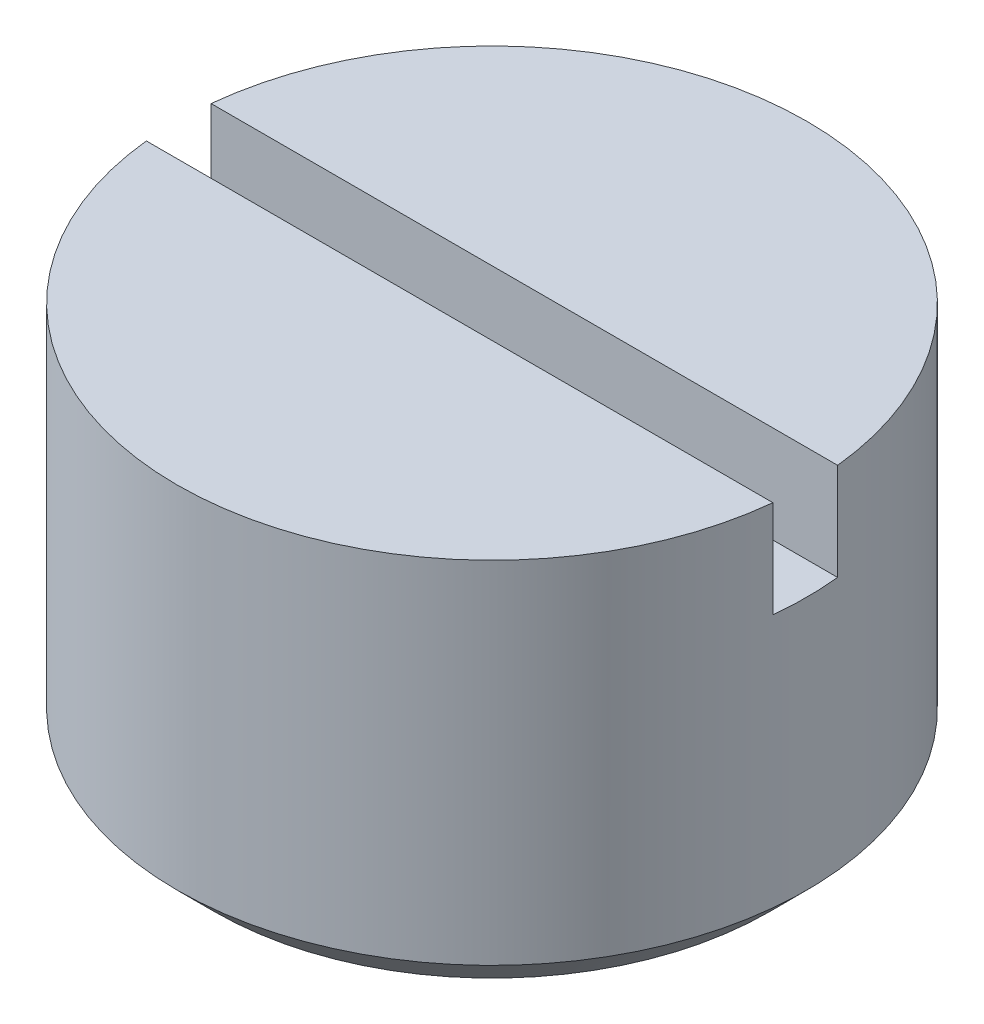
ISO-10303-21;
HEADER;
FILE_DESCRIPTION(('STEP AP214'),'2;1');
FILE_NAME('part.step','',(''),(''),'','','');
FILE_SCHEMA(('AUTOMOTIVE_DESIGN { 1 0 10303 214 1 1 1 1 }'));
ENDSEC;
DATA;
#1=APPLICATION_CONTEXT('core data for automotive mechanical design processes');
#2=APPLICATION_PROTOCOL_DEFINITION('international standard','automotive_design',2000,#1);
#3=PRODUCT_CONTEXT('',#1,'mechanical');
#4=PRODUCT('Part','Part','',(#3));
#5=PRODUCT_RELATED_PRODUCT_CATEGORY('part','',(#4));
#6=PRODUCT_DEFINITION_FORMATION('','',#4);
#7=PRODUCT_DEFINITION_CONTEXT('part definition',#1,'design');
#8=PRODUCT_DEFINITION('design','',#6,#7);
#9=PRODUCT_DEFINITION_SHAPE('','',#8);
#10=(LENGTH_UNIT() NAMED_UNIT(*) SI_UNIT(.MILLI.,.METRE.));
#11=(NAMED_UNIT(*) PLANE_ANGLE_UNIT() SI_UNIT($,.RADIAN.));
#12=(NAMED_UNIT(*) SI_UNIT($,.STERADIAN.) SOLID_ANGLE_UNIT());
#13=UNCERTAINTY_MEASURE_WITH_UNIT(LENGTH_MEASURE(1.E-05),#10,'distance_accuracy_value','');
#14=(GEOMETRIC_REPRESENTATION_CONTEXT(3) GLOBAL_UNCERTAINTY_ASSIGNED_CONTEXT((#13)) GLOBAL_UNIT_ASSIGNED_CONTEXT((#10,
#11,#12)) REPRESENTATION_CONTEXT('',''));
#15=CARTESIAN_POINT('',(0.,0.,0.));
#16=DIRECTION('',(0.,0.,1.));
#17=DIRECTION('',(1.,0.,0.));
#18=AXIS2_PLACEMENT_3D('',#15,#16,#17);
#19=CARTESIAN_POINT('',(0.,0.,0.));
#20=DIRECTION('',(0.,-1.,0.));
#21=DIRECTION('',(0.,0.,-1.));
#22=AXIS2_PLACEMENT_3D('',#19,#20,#21);
#23=PLANE('',#22);
#24=CARTESIAN_POINT('',(0.,0.,0.));
#25=DIRECTION('',(0.,1.,0.));
#26=DIRECTION('',(0.,0.,1.));
#27=AXIS2_PLACEMENT_3D('',#24,#25,#26);
#28=CIRCLE('',#27,4.864);
#29=CARTESIAN_POINT('',(4.83823273520404,0.,-0.5));
#30=VERTEX_POINT('',#29);
#31=CARTESIAN_POINT('',(-4.83823273520404,0.,-0.5));
#32=VERTEX_POINT('',#31);
#33=EDGE_CURVE('E83',#30,#32,#28,.T.);
#34=ORIENTED_EDGE('',*,*,#33,.T.);
#35=DIRECTION('',(-1.,0.,0.));
#36=VECTOR('',#35,1.);
#37=CARTESIAN_POINT('',(4.864,0.,-0.5));
#38=LINE('',#37,#36);
#39=EDGE_CURVE('E77',#30,#32,#38,.T.);
#40=ORIENTED_EDGE('',*,*,#39,.F.);
#41=EDGE_LOOP('',(#34,#40));
#42=FACE_BOUND('',#41,.T.);
#43=ADVANCED_FACE('F33',(#42),#23,.F.);
#44=CARTESIAN_POINT('',(-4.83823273520404,0.,0.5));
#45=VERTEX_POINT('',#44);
#46=CARTESIAN_POINT('',(4.83823273520404,0.,0.5));
#47=VERTEX_POINT('',#46);
#48=EDGE_CURVE('E89',#45,#47,#28,.T.);
#49=ORIENTED_EDGE('',*,*,#48,.T.);
#50=DIRECTION('',(1.,0.,0.));
#51=VECTOR('',#50,1.);
#52=CARTESIAN_POINT('',(-4.864,0.,0.5));
#53=LINE('',#52,#51);
#54=EDGE_CURVE('E84',#45,#47,#53,.T.);
#55=ORIENTED_EDGE('',*,*,#54,.F.);
#56=EDGE_LOOP('',(#49,#55));
#57=FACE_BOUND('',#56,.T.);
#58=ADVANCED_FACE('F35',(#57),#23,.F.);
#59=CARTESIAN_POINT('',(0.,-6.,0.));
#60=DIRECTION('',(0.,1.,0.));
#61=DIRECTION('',(0.,0.,1.));
#62=AXIS2_PLACEMENT_3D('',#59,#60,#61);
#63=CYLINDRICAL_SURFACE('',#62,4.864);
#64=ORIENTED_EDGE('',*,*,#33,.F.);
#65=DIRECTION('',(0.,1.,0.));
#66=VECTOR('',#65,1.);
#67=CARTESIAN_POINT('',(4.83823273520404,-6.,-0.5));
#68=LINE('',#67,#66);
#69=CARTESIAN_POINT('',(4.83823273520404,-1.5,-0.5));
#70=VERTEX_POINT('',#69);
#71=EDGE_CURVE('E11',#30,#70,#68,.F.);
#72=ORIENTED_EDGE('',*,*,#71,.T.);
#73=CARTESIAN_POINT('',(0.,-1.5,0.));
#74=DIRECTION('',(0.,1.,0.));
#75=DIRECTION('',(0.,0.,1.));
#76=AXIS2_PLACEMENT_3D('',#73,#74,#75);
#77=CIRCLE('',#76,4.864);
#78=CARTESIAN_POINT('',(4.83823273520404,-1.5,0.5));
#79=VERTEX_POINT('',#78);
#80=EDGE_CURVE('E47',#79,#70,#77,.T.);
#81=ORIENTED_EDGE('',*,*,#80,.F.);
#82=DIRECTION('',(0.,1.,0.));
#83=VECTOR('',#82,1.);
#84=CARTESIAN_POINT('',(4.83823273520404,-6.,0.5));
#85=LINE('',#84,#83);
#86=EDGE_CURVE('E41',#79,#47,#85,.T.);
#87=ORIENTED_EDGE('',*,*,#86,.T.);
#88=ORIENTED_EDGE('',*,*,#48,.F.);
#89=DIRECTION('',(0.,1.,0.));
#90=VECTOR('',#89,1.);
#91=CARTESIAN_POINT('',(-4.83823273520404,-6.,0.5));
#92=LINE('',#91,#90);
#93=CARTESIAN_POINT('',(-4.83823273520404,-1.5,0.5));
#94=VERTEX_POINT('',#93);
#95=EDGE_CURVE('E91',#45,#94,#92,.F.);
#96=ORIENTED_EDGE('',*,*,#95,.T.);
#97=CARTESIAN_POINT('',(-4.83823273520404,-1.5,-0.5));
#98=VERTEX_POINT('',#97);
#99=EDGE_CURVE('E55',#98,#94,#77,.T.);
#100=ORIENTED_EDGE('',*,*,#99,.F.);
#101=DIRECTION('',(0.,1.,0.));
#102=VECTOR('',#101,1.);
#103=CARTESIAN_POINT('',(-4.83823273520404,-6.,-0.5));
#104=LINE('',#103,#102);
#105=EDGE_CURVE('E88',#98,#32,#104,.T.);
#106=ORIENTED_EDGE('',*,*,#105,.T.);
#107=EDGE_LOOP('',(#64,#72,#81,#87,#88,#96,#100,#106));
#108=FACE_BOUND('',#107,.T.);
#109=CARTESIAN_POINT('',(0.,-5.419,0.));
#110=DIRECTION('',(0.,1.,0.));
#111=DIRECTION('',(0.,0.,1.));
#112=AXIS2_PLACEMENT_3D('',#109,#110,#111);
#113=CIRCLE('',#112,4.864);
#114=CARTESIAN_POINT('',(0.,-5.419,4.864));
#115=VERTEX_POINT('',#114);
#116=EDGE_CURVE('E94',#115,#115,#113,.T.);
#117=ORIENTED_EDGE('',*,*,#116,.T.);
#118=EDGE_LOOP('',(#117));
#119=FACE_BOUND('',#118,.T.);
#120=ADVANCED_FACE('F86',(#108,#119),#63,.T.);
#121=CARTESIAN_POINT('',(0.,-6.,0.));
#122=DIRECTION('',(0.,1.,0.));
#123=DIRECTION('',(0.,0.,1.));
#124=AXIS2_PLACEMENT_3D('',#121,#122,#123);
#125=CONICAL_SURFACE('',#124,4.283,0.785398163397448);
#126=ORIENTED_EDGE('',*,*,#116,.F.);
#127=EDGE_LOOP('',(#126));
#128=FACE_BOUND('',#127,.T.);
#129=CARTESIAN_POINT('',(0.,-6.,0.));
#130=DIRECTION('',(0.,1.,0.));
#131=DIRECTION('',(0.,0.,1.));
#132=AXIS2_PLACEMENT_3D('',#129,#130,#131);
#133=CIRCLE('',#132,4.283);
#134=CARTESIAN_POINT('',(0.,-6.,4.283));
#135=VERTEX_POINT('',#134);
#136=EDGE_CURVE('E104',#135,#135,#133,.T.);
#137=ORIENTED_EDGE('',*,*,#136,.T.);
#138=EDGE_LOOP('',(#137));
#139=FACE_BOUND('',#138,.T.);
#140=ADVANCED_FACE('F117',(#128,#139),#125,.T.);
#141=CARTESIAN_POINT('',(4.283,-6.,0.));
#142=DIRECTION('',(0.,1.,0.));
#143=DIRECTION('',(0.,0.,1.));
#144=AXIS2_PLACEMENT_3D('',#141,#142,#143);
#145=PLANE('',#144);
#146=ORIENTED_EDGE('',*,*,#136,.F.);
#147=EDGE_LOOP('',(#146));
#148=FACE_BOUND('',#147,.T.);
#149=ADVANCED_FACE('F127',(#148),#145,.F.);
#150=CARTESIAN_POINT('',(4.864,-1.5,-0.5));
#151=DIRECTION('',(0.,0.,-1.));
#152=DIRECTION('',(-1.,0.,0.));
#153=AXIS2_PLACEMENT_3D('',#150,#151,#152);
#154=PLANE('',#153);
#155=DIRECTION('',(-1.,0.,0.));
#156=VECTOR('',#155,1.);
#157=CARTESIAN_POINT('',(4.864,-1.5,-0.5));
#158=LINE('',#157,#156);
#159=EDGE_CURVE('E79',#70,#98,#158,.T.);
#160=ORIENTED_EDGE('',*,*,#159,.F.);
#161=ORIENTED_EDGE('',*,*,#71,.F.);
#162=ORIENTED_EDGE('',*,*,#39,.T.);
#163=ORIENTED_EDGE('',*,*,#105,.F.);
#164=EDGE_LOOP('',(#160,#161,#162,#163));
#165=FACE_BOUND('',#164,.T.);
#166=ADVANCED_FACE('F75',(#165),#154,.F.);
#167=CARTESIAN_POINT('',(-4.864,-1.5,0.5));
#168=DIRECTION('',(0.,0.,1.));
#169=DIRECTION('',(1.,0.,0.));
#170=AXIS2_PLACEMENT_3D('',#167,#168,#169);
#171=PLANE('',#170);
#172=DIRECTION('',(1.,0.,0.));
#173=VECTOR('',#172,1.);
#174=CARTESIAN_POINT('',(-4.864,-1.5,0.5));
#175=LINE('',#174,#173);
#176=EDGE_CURVE('E102',#94,#79,#175,.T.);
#177=ORIENTED_EDGE('',*,*,#176,.F.);
#178=ORIENTED_EDGE('',*,*,#95,.F.);
#179=ORIENTED_EDGE('',*,*,#54,.T.);
#180=ORIENTED_EDGE('',*,*,#86,.F.);
#181=EDGE_LOOP('',(#177,#178,#179,#180));
#182=FACE_BOUND('',#181,.T.);
#183=ADVANCED_FACE('F110',(#182),#171,.F.);
#184=CARTESIAN_POINT('',(0.,-1.5,0.));
#185=DIRECTION('',(0.,1.,0.));
#186=DIRECTION('',(0.,0.,1.));
#187=AXIS2_PLACEMENT_3D('',#184,#185,#186);
#188=PLANE('',#187);
#189=ORIENTED_EDGE('',*,*,#176,.T.);
#190=ORIENTED_EDGE('',*,*,#80,.T.);
#191=ORIENTED_EDGE('',*,*,#159,.T.);
#192=ORIENTED_EDGE('',*,*,#99,.T.);
#193=EDGE_LOOP('',(#189,#190,#191,#192));
#194=FACE_BOUND('',#193,.T.);
#195=ADVANCED_FACE('F101',(#194),#188,.T.);
#196=CLOSED_SHELL('',(#43,#58,#120,#140,#149,#166,#183,#195));
#197=MANIFOLD_SOLID_BREP('B2',#196);
#198=ADVANCED_BREP_SHAPE_REPRESENTATION('',(#18,#197),#14);
#199=SHAPE_DEFINITION_REPRESENTATION(#9,#198);
ENDSEC;
END-ISO-10303-21;
